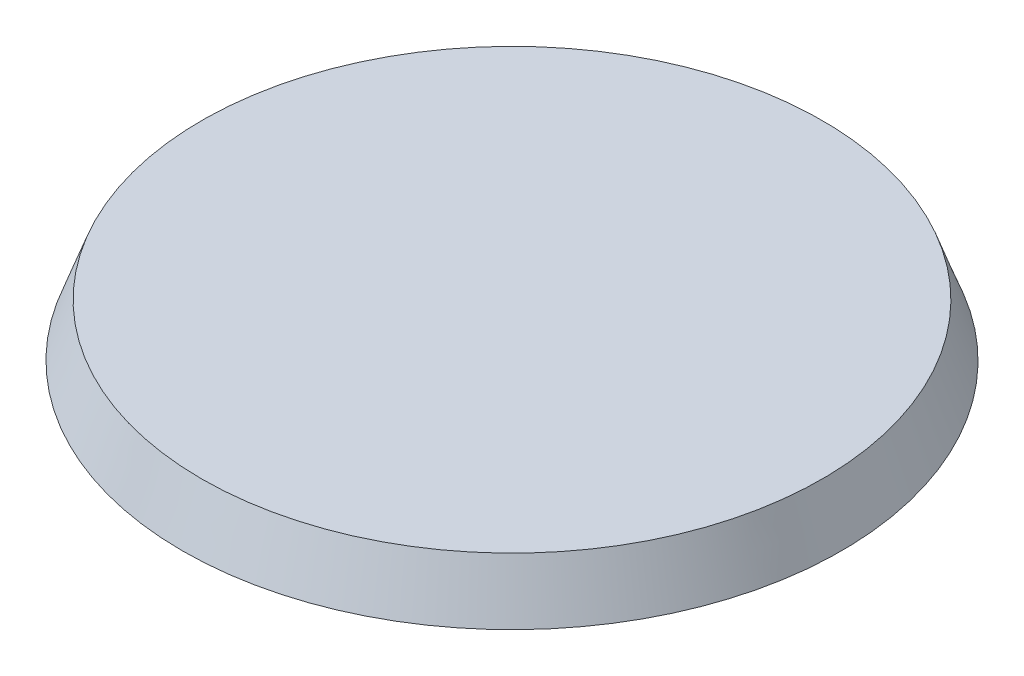
ISO-10303-21;
HEADER;
FILE_DESCRIPTION(('STEP AP214'),'2;1');
FILE_NAME('part.step','',(''),(''),'','','');
FILE_SCHEMA(('AUTOMOTIVE_DESIGN { 1 0 10303 214 1 1 1 1 }'));
ENDSEC;
DATA;
#1=APPLICATION_CONTEXT('core data for automotive mechanical design processes');
#2=APPLICATION_PROTOCOL_DEFINITION('international standard','automotive_design',2000,#1);
#3=PRODUCT_CONTEXT('',#1,'mechanical');
#4=PRODUCT('Part','Part','',(#3));
#5=PRODUCT_RELATED_PRODUCT_CATEGORY('part','',(#4));
#6=PRODUCT_DEFINITION_FORMATION('','',#4);
#7=PRODUCT_DEFINITION_CONTEXT('part definition',#1,'design');
#8=PRODUCT_DEFINITION('design','',#6,#7);
#9=PRODUCT_DEFINITION_SHAPE('','',#8);
#10=(LENGTH_UNIT() NAMED_UNIT(*) SI_UNIT(.MILLI.,.METRE.));
#11=(NAMED_UNIT(*) PLANE_ANGLE_UNIT() SI_UNIT($,.RADIAN.));
#12=(NAMED_UNIT(*) SI_UNIT($,.STERADIAN.) SOLID_ANGLE_UNIT());
#13=UNCERTAINTY_MEASURE_WITH_UNIT(LENGTH_MEASURE(1.E-05),#10,'distance_accuracy_value','');
#14=(GEOMETRIC_REPRESENTATION_CONTEXT(3) GLOBAL_UNCERTAINTY_ASSIGNED_CONTEXT((#13)) GLOBAL_UNIT_ASSIGNED_CONTEXT((#10,
#11,#12)) REPRESENTATION_CONTEXT('',''));
#15=CARTESIAN_POINT('',(0.,0.,0.));
#16=DIRECTION('',(0.,0.,1.));
#17=DIRECTION('',(1.,0.,0.));
#18=AXIS2_PLACEMENT_3D('',#15,#16,#17);
#19=CARTESIAN_POINT('',(0.,0.,0.));
#20=DIRECTION('',(0.,-1.,0.));
#21=DIRECTION('',(0.,0.,1.));
#22=AXIS2_PLACEMENT_3D('',#19,#20,#21);
#23=CONICAL_SURFACE('',#22,25.,0.349065850398867);
#24=CARTESIAN_POINT('',(0.,4.,0.));
#25=DIRECTION('',(0.,1.,0.));
#26=DIRECTION('',(0.,0.,1.));
#27=AXIS2_PLACEMENT_3D('',#24,#25,#26);
#28=CIRCLE('',#27,23.5441190629352);
#29=CARTESIAN_POINT('',(0.,4.,23.5441190629352));
#30=VERTEX_POINT('',#29);
#31=EDGE_CURVE('E10',#30,#30,#28,.T.);
#32=ORIENTED_EDGE('',*,*,#31,.F.);
#33=EDGE_LOOP('',(#32));
#34=FACE_BOUND('',#33,.T.);
#35=CARTESIAN_POINT('',(0.,0.,0.));
#36=DIRECTION('',(0.,1.,0.));
#37=DIRECTION('',(0.,0.,1.));
#38=AXIS2_PLACEMENT_3D('',#35,#36,#37);
#39=CIRCLE('',#38,25.);
#40=CARTESIAN_POINT('',(0.,0.,25.));
#41=VERTEX_POINT('',#40);
#42=EDGE_CURVE('E37',#41,#41,#39,.T.);
#43=ORIENTED_EDGE('',*,*,#42,.T.);
#44=EDGE_LOOP('',(#43));
#45=FACE_BOUND('',#44,.T.);
#46=ADVANCED_FACE('F31',(#34,#45),#23,.T.);
#47=CARTESIAN_POINT('',(0.,4.,0.));
#48=DIRECTION('',(0.,1.,0.));
#49=DIRECTION('',(0.,0.,1.));
#50=AXIS2_PLACEMENT_3D('',#47,#48,#49);
#51=PLANE('',#50);
#52=ORIENTED_EDGE('',*,*,#31,.T.);
#53=EDGE_LOOP('',(#52));
#54=FACE_BOUND('',#53,.T.);
#55=ADVANCED_FACE('F46',(#54),#51,.T.);
#56=CARTESIAN_POINT('',(0.,0.,0.));
#57=DIRECTION('',(0.,1.,0.));
#58=DIRECTION('',(0.,0.,1.));
#59=AXIS2_PLACEMENT_3D('',#56,#57,#58);
#60=PLANE('',#59);
#61=ORIENTED_EDGE('',*,*,#42,.F.);
#62=EDGE_LOOP('',(#61));
#63=FACE_BOUND('',#62,.T.);
#64=ADVANCED_FACE('F44',(#63),#60,.F.);
#65=CLOSED_SHELL('',(#46,#55,#64));
#66=MANIFOLD_SOLID_BREP('B2',#65);
#67=ADVANCED_BREP_SHAPE_REPRESENTATION('',(#18,#66),#14);
#68=SHAPE_DEFINITION_REPRESENTATION(#9,#67);
ENDSEC;
END-ISO-10303-21;
